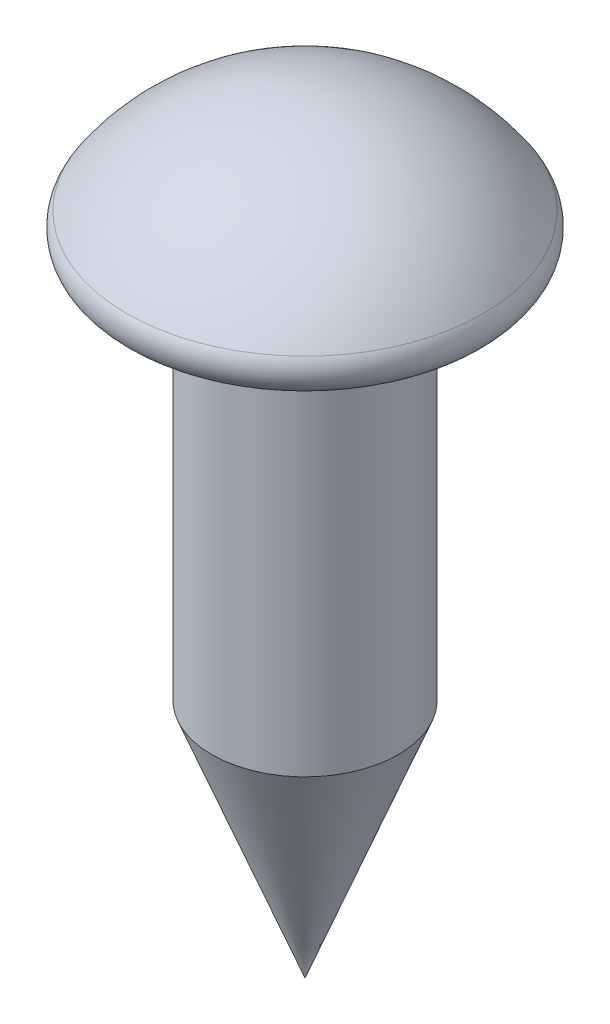
ISO-10303-21;
HEADER;
FILE_DESCRIPTION(('STEP AP214'),'2;1');
FILE_NAME('part.step','',(''),(''),'','','');
FILE_SCHEMA(('AUTOMOTIVE_DESIGN { 1 0 10303 214 1 1 1 1 }'));
ENDSEC;
DATA;
#1=APPLICATION_CONTEXT('core data for automotive mechanical design processes');
#2=APPLICATION_PROTOCOL_DEFINITION('international standard','automotive_design',2000,#1);
#3=PRODUCT_CONTEXT('',#1,'mechanical');
#4=PRODUCT('Part','Part','',(#3));
#5=PRODUCT_RELATED_PRODUCT_CATEGORY('part','',(#4));
#6=PRODUCT_DEFINITION_FORMATION('','',#4);
#7=PRODUCT_DEFINITION_CONTEXT('part definition',#1,'design');
#8=PRODUCT_DEFINITION('design','',#6,#7);
#9=PRODUCT_DEFINITION_SHAPE('','',#8);
#10=(LENGTH_UNIT() NAMED_UNIT(*) SI_UNIT(.MILLI.,.METRE.));
#11=(NAMED_UNIT(*) PLANE_ANGLE_UNIT() SI_UNIT($,.RADIAN.));
#12=(NAMED_UNIT(*) SI_UNIT($,.STERADIAN.) SOLID_ANGLE_UNIT());
#13=UNCERTAINTY_MEASURE_WITH_UNIT(LENGTH_MEASURE(1.E-05),#10,'distance_accuracy_value','');
#14=(GEOMETRIC_REPRESENTATION_CONTEXT(3) GLOBAL_UNCERTAINTY_ASSIGNED_CONTEXT((#13)) GLOBAL_UNIT_ASSIGNED_CONTEXT((#10,
#11,#12)) REPRESENTATION_CONTEXT('',''));
#15=CARTESIAN_POINT('',(0.,0.,0.));
#16=DIRECTION('',(0.,0.,1.));
#17=DIRECTION('',(1.,0.,0.));
#18=AXIS2_PLACEMENT_3D('',#15,#16,#17);
#19=CARTESIAN_POINT('',(0.,0.381000000000001,0.));
#20=DIRECTION('',(0.,1.,0.));
#21=DIRECTION('',(0.,0.,1.));
#22=AXIS2_PLACEMENT_3D('',#19,#20,#21);
#23=TOROIDAL_SURFACE('',#22,2.4003,0.381);
#24=CARTESIAN_POINT('',(0.,0.595336978631264,0.));
#25=DIRECTION('',(0.,1.,0.));
#26=DIRECTION('',(0.,0.,1.));
#27=AXIS2_PLACEMENT_3D('',#24,#25,#26);
#28=CIRCLE('',#27,2.71529311038691);
#29=CARTESIAN_POINT('',(0.,0.595336978631264,2.71529311038691));
#30=VERTEX_POINT('',#29);
#31=EDGE_CURVE('E11',#30,#30,#28,.T.);
#32=ORIENTED_EDGE('',*,*,#31,.F.);
#33=EDGE_LOOP('',(#32));
#34=FACE_BOUND('',#33,.T.);
#35=CARTESIAN_POINT('',(0.,0.,0.));
#36=DIRECTION('',(0.,1.,0.));
#37=DIRECTION('',(0.,0.,1.));
#38=AXIS2_PLACEMENT_3D('',#35,#36,#37);
#39=CIRCLE('',#38,2.4003);
#40=CARTESIAN_POINT('',(0.,0.,2.4003));
#41=VERTEX_POINT('',#40);
#42=EDGE_CURVE('E67',#41,#41,#39,.T.);
#43=ORIENTED_EDGE('',*,*,#42,.T.);
#44=EDGE_LOOP('',(#43));
#45=FACE_BOUND('',#44,.T.);
#46=ADVANCED_FACE('F35',(#34,#45),#23,.T.);
#47=CARTESIAN_POINT('',(0.,-1.2522835,0.));
#48=DIRECTION('',(0.,1.,0.));
#49=DIRECTION('',(1.,0.,0.));
#50=AXIS2_PLACEMENT_3D('',#47,#48,#49);
#51=SPHERICAL_SURFACE('',#50,3.2842835);
#52=ORIENTED_EDGE('',*,*,#31,.T.);
#53=EDGE_LOOP('',(#52));
#54=FACE_BOUND('',#53,.T.);
#55=ADVANCED_FACE('F47',(#54),#51,.T.);
#56=CARTESIAN_POINT('',(0.,-9.525,0.));
#57=DIRECTION('',(0.,1.,0.));
#58=DIRECTION('',(0.,0.,1.));
#59=AXIS2_PLACEMENT_3D('',#56,#57,#58);
#60=CONICAL_SURFACE('',#59,0.,0.370882466048792);
#61=CARTESIAN_POINT('',(0.,-5.86730446797042,0.));
#62=DIRECTION('',(0.,1.,0.));
#63=DIRECTION('',(0.,0.,1.));
#64=AXIS2_PLACEMENT_3D('',#61,#62,#63);
#65=CIRCLE('',#64,1.4224);
#66=CARTESIAN_POINT('',(0.,-5.86730446797042,1.4224));
#67=VERTEX_POINT('',#66);
#68=EDGE_CURVE('E41',#67,#67,#65,.T.);
#69=ORIENTED_EDGE('',*,*,#68,.F.);
#70=EDGE_LOOP('',(#69));
#71=FACE_BOUND('',#70,.T.);
#72=CARTESIAN_POINT('',(0.,-9.525,0.));
#73=VERTEX_POINT('',#72);
#74=VERTEX_LOOP('',#73);
#75=FACE_BOUND('',#74,.T.);
#76=ADVANCED_FACE('F44',(#71,#75),#60,.T.);
#77=CARTESIAN_POINT('',(0.,2.032,0.));
#78=DIRECTION('',(0.,1.,0.));
#79=DIRECTION('',(0.,0.,1.));
#80=AXIS2_PLACEMENT_3D('',#77,#78,#79);
#81=CYLINDRICAL_SURFACE('',#80,1.4224);
#82=CARTESIAN_POINT('',(0.,0.,0.));
#83=DIRECTION('',(0.,1.,0.));
#84=DIRECTION('',(0.,0.,1.));
#85=AXIS2_PLACEMENT_3D('',#82,#83,#84);
#86=CIRCLE('',#85,1.4224);
#87=CARTESIAN_POINT('',(0.,0.,1.4224));
#88=VERTEX_POINT('',#87);
#89=EDGE_CURVE('E69',#88,#88,#86,.T.);
#90=ORIENTED_EDGE('',*,*,#89,.F.);
#91=EDGE_LOOP('',(#90));
#92=FACE_BOUND('',#91,.T.);
#93=ORIENTED_EDGE('',*,*,#68,.T.);
#94=EDGE_LOOP('',(#93));
#95=FACE_BOUND('',#94,.T.);
#96=ADVANCED_FACE('F46',(#92,#95),#81,.T.);
#97=CARTESIAN_POINT('',(0.,0.,0.));
#98=DIRECTION('',(0.,1.,0.));
#99=DIRECTION('',(0.,0.,1.));
#100=AXIS2_PLACEMENT_3D('',#97,#98,#99);
#101=PLANE('',#100);
#102=ORIENTED_EDGE('',*,*,#42,.F.);
#103=EDGE_LOOP('',(#102));
#104=FACE_BOUND('',#103,.T.);
#105=ORIENTED_EDGE('',*,*,#89,.T.);
#106=EDGE_LOOP('',(#105));
#107=FACE_BOUND('',#106,.T.);
#108=ADVANCED_FACE('F54',(#104,#107),#101,.F.);
#109=CLOSED_SHELL('',(#46,#55,#76,#96,#108));
#110=MANIFOLD_SOLID_BREP('B2',#109);
#111=ADVANCED_BREP_SHAPE_REPRESENTATION('',(#18,#110),#14);
#112=SHAPE_DEFINITION_REPRESENTATION(#9,#111);
ENDSEC;
END-ISO-10303-21;
